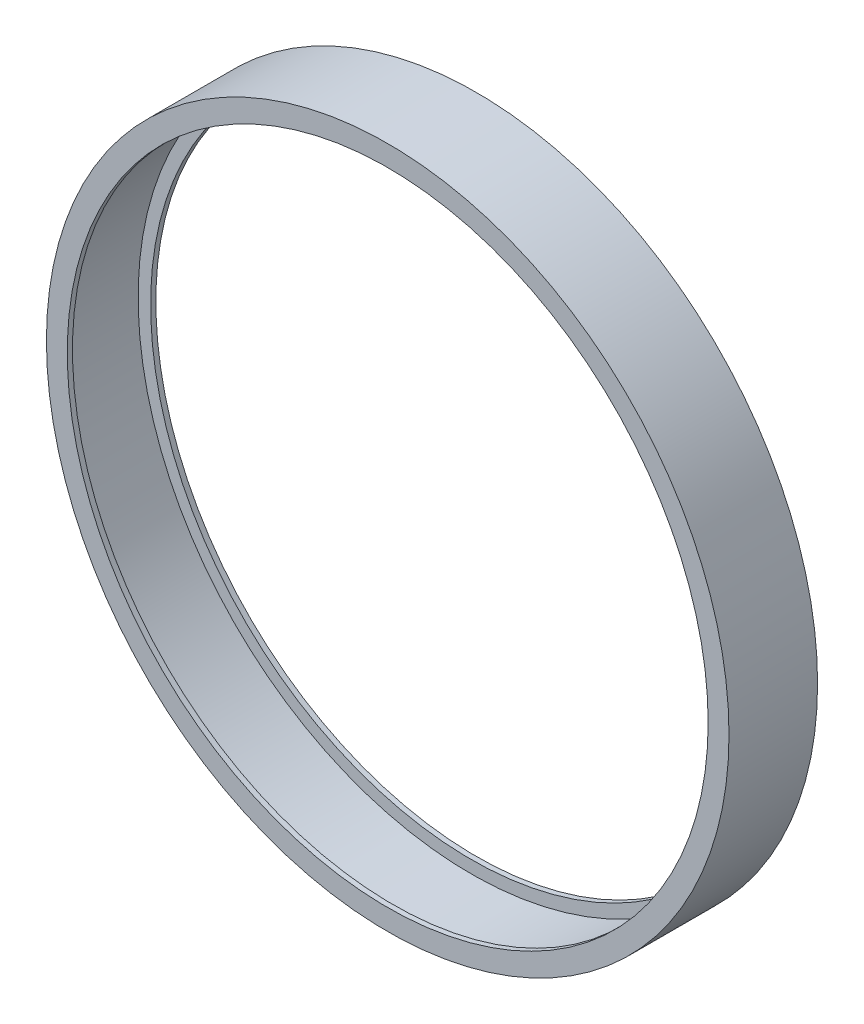
ISO-10303-21;
HEADER;
FILE_DESCRIPTION(('STEP AP214'),'2;1');
FILE_NAME('part.step','',(''),(''),'','','');
FILE_SCHEMA(('AUTOMOTIVE_DESIGN { 1 0 10303 214 1 1 1 1 }'));
ENDSEC;
DATA;
#1=APPLICATION_CONTEXT('core data for automotive mechanical design processes');
#2=APPLICATION_PROTOCOL_DEFINITION('international standard','automotive_design',2000,#1);
#3=PRODUCT_CONTEXT('',#1,'mechanical');
#4=PRODUCT('Part','Part','',(#3));
#5=PRODUCT_RELATED_PRODUCT_CATEGORY('part','',(#4));
#6=PRODUCT_DEFINITION_FORMATION('','',#4);
#7=PRODUCT_DEFINITION_CONTEXT('part definition',#1,'design');
#8=PRODUCT_DEFINITION('design','',#6,#7);
#9=PRODUCT_DEFINITION_SHAPE('','',#8);
#10=(LENGTH_UNIT() NAMED_UNIT(*) SI_UNIT(.MILLI.,.METRE.));
#11=(NAMED_UNIT(*) PLANE_ANGLE_UNIT() SI_UNIT($,.RADIAN.));
#12=(NAMED_UNIT(*) SI_UNIT($,.STERADIAN.) SOLID_ANGLE_UNIT());
#13=UNCERTAINTY_MEASURE_WITH_UNIT(LENGTH_MEASURE(1.E-05),#10,'distance_accuracy_value','');
#14=(GEOMETRIC_REPRESENTATION_CONTEXT(3) GLOBAL_UNCERTAINTY_ASSIGNED_CONTEXT((#13)) GLOBAL_UNIT_ASSIGNED_CONTEXT((#10,
#11,#12)) REPRESENTATION_CONTEXT('',''));
#15=CARTESIAN_POINT('',(0.,0.,0.));
#16=DIRECTION('',(0.,0.,1.));
#17=DIRECTION('',(1.,0.,0.));
#18=AXIS2_PLACEMENT_3D('',#15,#16,#17);
#19=CARTESIAN_POINT('',(0.,0.,0.));
#20=DIRECTION('',(0.,0.,-1.));
#21=DIRECTION('',(-1.,0.,0.));
#22=AXIS2_PLACEMENT_3D('',#19,#20,#21);
#23=PLANE('',#22);
#24=CARTESIAN_POINT('',(0.,-32.75,0.));
#25=DIRECTION('',(0.,0.,1.));
#26=DIRECTION('',(1.,0.,0.));
#27=AXIS2_PLACEMENT_3D('',#24,#25,#26);
#28=CIRCLE('',#27,30.75);
#29=CARTESIAN_POINT('',(30.75,-32.75,0.));
#30=VERTEX_POINT('',#29);
#31=EDGE_CURVE('E10',#30,#30,#28,.T.);
#32=ORIENTED_EDGE('',*,*,#31,.F.);
#33=EDGE_LOOP('',(#32));
#34=FACE_BOUND('',#33,.T.);
#35=CARTESIAN_POINT('',(0.,-32.75,0.));
#36=DIRECTION('',(0.,0.,1.));
#37=DIRECTION('',(1.,0.,0.));
#38=AXIS2_PLACEMENT_3D('',#35,#36,#37);
#39=CIRCLE('',#38,32.75);
#40=CARTESIAN_POINT('',(32.75,-32.75,0.));
#41=VERTEX_POINT('',#40);
#42=EDGE_CURVE('E58',#41,#41,#39,.T.);
#43=ORIENTED_EDGE('',*,*,#42,.T.);
#44=EDGE_LOOP('',(#43));
#45=FACE_BOUND('',#44,.T.);
#46=ADVANCED_FACE('F30',(#34,#45),#23,.F.);
#47=CARTESIAN_POINT('',(0.,-32.75,15.4682964772586));
#48=DIRECTION('',(0.,0.,1.));
#49=DIRECTION('',(1.,0.,0.));
#50=AXIS2_PLACEMENT_3D('',#47,#48,#49);
#51=CYLINDRICAL_SURFACE('',#50,30.75);
#52=CARTESIAN_POINT('',(0.,-32.75,-0.5));
#53=DIRECTION('',(0.,0.,1.));
#54=DIRECTION('',(1.,0.,0.));
#55=AXIS2_PLACEMENT_3D('',#52,#53,#54);
#56=CIRCLE('',#55,30.75);
#57=CARTESIAN_POINT('',(30.75,-32.75,-0.5));
#58=VERTEX_POINT('',#57);
#59=EDGE_CURVE('E36',#58,#58,#56,.T.);
#60=ORIENTED_EDGE('',*,*,#59,.F.);
#61=EDGE_LOOP('',(#60));
#62=FACE_BOUND('',#61,.T.);
#63=ORIENTED_EDGE('',*,*,#31,.T.);
#64=EDGE_LOOP('',(#63));
#65=FACE_BOUND('',#64,.T.);
#66=ADVANCED_FACE('F95',(#62,#65),#51,.F.);
#67=CARTESIAN_POINT('',(0.,-2.,-0.5));
#68=DIRECTION('',(0.,0.,1.));
#69=DIRECTION('',(1.,0.,0.));
#70=AXIS2_PLACEMENT_3D('',#67,#68,#69);
#71=PLANE('',#70);
#72=CARTESIAN_POINT('',(0.,-32.75,-0.5));
#73=DIRECTION('',(0.,0.,1.));
#74=DIRECTION('',(1.,0.,0.));
#75=AXIS2_PLACEMENT_3D('',#72,#73,#74);
#76=CIRCLE('',#75,31.95);
#77=CARTESIAN_POINT('',(31.95,-32.75,-0.5));
#78=VERTEX_POINT('',#77);
#79=EDGE_CURVE('E40',#78,#78,#76,.T.);
#80=ORIENTED_EDGE('',*,*,#79,.F.);
#81=EDGE_LOOP('',(#80));
#82=FACE_BOUND('',#81,.T.);
#83=ORIENTED_EDGE('',*,*,#59,.T.);
#84=EDGE_LOOP('',(#83));
#85=FACE_BOUND('',#84,.T.);
#86=ADVANCED_FACE('F90',(#82,#85),#71,.F.);
#87=CARTESIAN_POINT('',(0.,-32.75,15.4682964772586));
#88=DIRECTION('',(0.,0.,1.));
#89=DIRECTION('',(1.,0.,0.));
#90=AXIS2_PLACEMENT_3D('',#87,#88,#89);
#91=CYLINDRICAL_SURFACE('',#90,31.95);
#92=CARTESIAN_POINT('',(0.,-32.75,-8.));
#93=DIRECTION('',(0.,0.,1.));
#94=DIRECTION('',(1.,0.,0.));
#95=AXIS2_PLACEMENT_3D('',#92,#93,#94);
#96=CIRCLE('',#95,31.95);
#97=CARTESIAN_POINT('',(31.95,-32.75,-8.));
#98=VERTEX_POINT('',#97);
#99=EDGE_CURVE('E44',#98,#98,#96,.T.);
#100=ORIENTED_EDGE('',*,*,#99,.F.);
#101=EDGE_LOOP('',(#100));
#102=FACE_BOUND('',#101,.T.);
#103=ORIENTED_EDGE('',*,*,#79,.T.);
#104=EDGE_LOOP('',(#103));
#105=FACE_BOUND('',#104,.T.);
#106=ADVANCED_FACE('F84',(#102,#105),#91,.F.);
#107=CARTESIAN_POINT('',(0.,-2.,-8.));
#108=DIRECTION('',(0.,0.,-1.));
#109=DIRECTION('',(-1.,0.,0.));
#110=AXIS2_PLACEMENT_3D('',#107,#108,#109);
#111=PLANE('',#110);
#112=CARTESIAN_POINT('',(0.,-32.75,-8.));
#113=DIRECTION('',(0.,0.,1.));
#114=DIRECTION('',(1.,0.,0.));
#115=AXIS2_PLACEMENT_3D('',#112,#113,#114);
#116=CIRCLE('',#115,30.75);
#117=CARTESIAN_POINT('',(30.75,-32.75,-8.));
#118=VERTEX_POINT('',#117);
#119=EDGE_CURVE('E49',#118,#118,#116,.T.);
#120=ORIENTED_EDGE('',*,*,#119,.F.);
#121=EDGE_LOOP('',(#120));
#122=FACE_BOUND('',#121,.T.);
#123=ORIENTED_EDGE('',*,*,#99,.T.);
#124=EDGE_LOOP('',(#123));
#125=FACE_BOUND('',#124,.T.);
#126=ADVANCED_FACE('F78',(#122,#125),#111,.F.);
#127=CARTESIAN_POINT('',(0.,-32.75,15.4682964772586));
#128=DIRECTION('',(0.,0.,1.));
#129=DIRECTION('',(1.,0.,0.));
#130=AXIS2_PLACEMENT_3D('',#127,#128,#129);
#131=CYLINDRICAL_SURFACE('',#130,30.75);
#132=CARTESIAN_POINT('',(0.,-32.75,-8.5));
#133=DIRECTION('',(0.,0.,1.));
#134=DIRECTION('',(1.,0.,0.));
#135=AXIS2_PLACEMENT_3D('',#132,#133,#134);
#136=CIRCLE('',#135,30.75);
#137=CARTESIAN_POINT('',(30.75,-32.75,-8.5));
#138=VERTEX_POINT('',#137);
#139=EDGE_CURVE('E52',#138,#138,#136,.T.);
#140=ORIENTED_EDGE('',*,*,#139,.F.);
#141=EDGE_LOOP('',(#140));
#142=FACE_BOUND('',#141,.T.);
#143=ORIENTED_EDGE('',*,*,#119,.T.);
#144=EDGE_LOOP('',(#143));
#145=FACE_BOUND('',#144,.T.);
#146=ADVANCED_FACE('F72',(#142,#145),#131,.F.);
#147=CARTESIAN_POINT('',(0.,0.,-8.5));
#148=DIRECTION('',(0.,0.,1.));
#149=DIRECTION('',(1.,0.,0.));
#150=AXIS2_PLACEMENT_3D('',#147,#148,#149);
#151=PLANE('',#150);
#152=CARTESIAN_POINT('',(0.,-32.75,-8.5));
#153=DIRECTION('',(0.,0.,1.));
#154=DIRECTION('',(1.,0.,0.));
#155=AXIS2_PLACEMENT_3D('',#152,#153,#154);
#156=CIRCLE('',#155,32.75);
#157=CARTESIAN_POINT('',(32.75,-32.75,-8.5));
#158=VERTEX_POINT('',#157);
#159=EDGE_CURVE('E55',#158,#158,#156,.T.);
#160=ORIENTED_EDGE('',*,*,#159,.F.);
#161=EDGE_LOOP('',(#160));
#162=FACE_BOUND('',#161,.T.);
#163=ORIENTED_EDGE('',*,*,#139,.T.);
#164=EDGE_LOOP('',(#163));
#165=FACE_BOUND('',#164,.T.);
#166=ADVANCED_FACE('F66',(#162,#165),#151,.F.);
#167=CARTESIAN_POINT('',(0.,-32.75,15.4682964772586));
#168=DIRECTION('',(0.,0.,1.));
#169=DIRECTION('',(1.,0.,0.));
#170=AXIS2_PLACEMENT_3D('',#167,#168,#169);
#171=CYLINDRICAL_SURFACE('',#170,32.75);
#172=ORIENTED_EDGE('',*,*,#42,.F.);
#173=EDGE_LOOP('',(#172));
#174=FACE_BOUND('',#173,.T.);
#175=ORIENTED_EDGE('',*,*,#159,.T.);
#176=EDGE_LOOP('',(#175));
#177=FACE_BOUND('',#176,.T.);
#178=ADVANCED_FACE('F63',(#174,#177),#171,.T.);
#179=CLOSED_SHELL('',(#46,#66,#86,#106,#126,#146,#166,#178));
#180=MANIFOLD_SOLID_BREP('B2',#179);
#181=ADVANCED_BREP_SHAPE_REPRESENTATION('',(#18,#180),#14);
#182=SHAPE_DEFINITION_REPRESENTATION(#9,#181);
ENDSEC;
END-ISO-10303-21;
